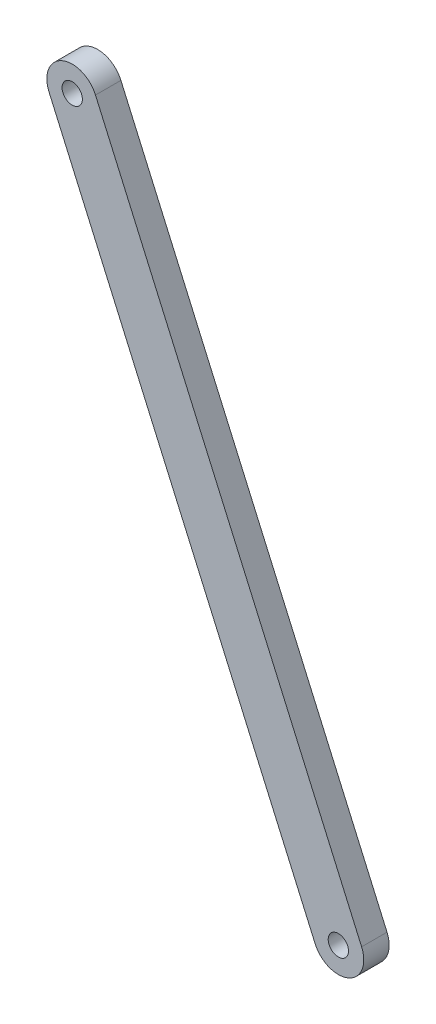
ISO-10303-21;
HEADER;
FILE_DESCRIPTION(('STEP AP214'),'2;1');
FILE_NAME('part.step','',(''),(''),'','','');
FILE_SCHEMA(('AUTOMOTIVE_DESIGN { 1 0 10303 214 1 1 1 1 }'));
ENDSEC;
DATA;
#1=APPLICATION_CONTEXT('core data for automotive mechanical design processes');
#2=APPLICATION_PROTOCOL_DEFINITION('international standard','automotive_design',2000,#1);
#3=PRODUCT_CONTEXT('',#1,'mechanical');
#4=PRODUCT('Part','Part','',(#3));
#5=PRODUCT_RELATED_PRODUCT_CATEGORY('part','',(#4));
#6=PRODUCT_DEFINITION_FORMATION('','',#4);
#7=PRODUCT_DEFINITION_CONTEXT('part definition',#1,'design');
#8=PRODUCT_DEFINITION('design','',#6,#7);
#9=PRODUCT_DEFINITION_SHAPE('','',#8);
#10=(LENGTH_UNIT() NAMED_UNIT(*) SI_UNIT(.MILLI.,.METRE.));
#11=(NAMED_UNIT(*) PLANE_ANGLE_UNIT() SI_UNIT($,.RADIAN.));
#12=(NAMED_UNIT(*) SI_UNIT($,.STERADIAN.) SOLID_ANGLE_UNIT());
#13=UNCERTAINTY_MEASURE_WITH_UNIT(LENGTH_MEASURE(1.E-05),#10,'distance_accuracy_value','');
#14=(GEOMETRIC_REPRESENTATION_CONTEXT(3) GLOBAL_UNCERTAINTY_ASSIGNED_CONTEXT((#13)) GLOBAL_UNIT_ASSIGNED_CONTEXT((#10,
#11,#12)) REPRESENTATION_CONTEXT('',''));
#15=CARTESIAN_POINT('',(0.,0.,0.));
#16=DIRECTION('',(0.,0.,1.));
#17=DIRECTION('',(1.,0.,0.));
#18=AXIS2_PLACEMENT_3D('',#15,#16,#17);
#19=CARTESIAN_POINT('',(-79.3875454378019,156.268923770412,-10.));
#20=DIRECTION('',(0.,0.,1.));
#21=DIRECTION('',(1.,0.,0.));
#22=AXIS2_PLACEMENT_3D('',#19,#20,#21);
#23=CYLINDRICAL_SURFACE('',#22,5.00000000000001);
#24=CARTESIAN_POINT('',(-79.3875454378019,156.268923770412,-5.));
#25=DIRECTION('',(0.,0.,1.));
#26=DIRECTION('',(1.,0.,0.));
#27=AXIS2_PLACEMENT_3D('',#24,#25,#26);
#28=CIRCLE('',#27,5.00000000000001);
#29=CARTESIAN_POINT('',(-74.8111879193475,158.283111413926,-5.));
#30=VERTEX_POINT('',#29);
#31=CARTESIAN_POINT('',(-83.9639029562564,154.254736126898,-5.));
#32=VERTEX_POINT('',#31);
#33=EDGE_CURVE('E98',#30,#32,#28,.T.);
#34=ORIENTED_EDGE('',*,*,#33,.F.);
#35=DIRECTION('',(0.,0.,1.));
#36=VECTOR('',#35,1.);
#37=CARTESIAN_POINT('',(-74.8111879193475,158.283111413926,-10.));
#38=LINE('',#37,#36);
#39=CARTESIAN_POINT('',(-74.8111879193475,158.283111413926,-10.));
#40=VERTEX_POINT('',#39);
#41=EDGE_CURVE('E11',#40,#30,#38,.T.);
#42=ORIENTED_EDGE('',*,*,#41,.F.);
#43=CARTESIAN_POINT('',(-79.3875454378019,156.268923770412,-10.));
#44=DIRECTION('',(0.,0.,1.));
#45=DIRECTION('',(1.,0.,0.));
#46=AXIS2_PLACEMENT_3D('',#43,#44,#45);
#47=CIRCLE('',#46,5.00000000000001);
#48=CARTESIAN_POINT('',(-83.9639029562564,154.254736126898,-10.));
#49=VERTEX_POINT('',#48);
#50=EDGE_CURVE('E91',#40,#49,#47,.T.);
#51=ORIENTED_EDGE('',*,*,#50,.T.);
#52=DIRECTION('',(0.,0.,1.));
#53=VECTOR('',#52,1.);
#54=CARTESIAN_POINT('',(-83.9639029562564,154.254736126898,-10.));
#55=LINE('',#54,#53);
#56=EDGE_CURVE('E36',#49,#32,#55,.T.);
#57=ORIENTED_EDGE('',*,*,#56,.T.);
#58=EDGE_LOOP('',(#34,#42,#51,#57));
#59=FACE_BOUND('',#58,.T.);
#60=ADVANCED_FACE('F33',(#59),#23,.T.);
#61=CARTESIAN_POINT('',(-74.8111879193475,158.283111413926,-10.));
#62=DIRECTION('',(0.915271503690887,0.402837528702853,0.));
#63=DIRECTION('',(-0.402837528702853,0.915271503690887,0.));
#64=AXIS2_PLACEMENT_3D('',#61,#62,#63);
#65=PLANE('',#64);
#66=DIRECTION('',(-0.402837528702853,0.915271503690887,0.));
#67=VECTOR('',#66,1.);
#68=CARTESIAN_POINT('',(-74.8111879193475,158.283111413926,-5.));
#69=LINE('',#68,#67);
#70=CARTESIAN_POINT('',(-22.4423091879765,39.297815934111,-5.));
#71=VERTEX_POINT('',#70);
#72=EDGE_CURVE('E93',#71,#30,#69,.T.);
#73=ORIENTED_EDGE('',*,*,#72,.F.);
#74=DIRECTION('',(0.,0.,1.));
#75=VECTOR('',#74,1.);
#76=CARTESIAN_POINT('',(-22.4423091879765,39.297815934111,-10.));
#77=LINE('',#76,#75);
#78=CARTESIAN_POINT('',(-22.4423091879765,39.297815934111,-10.));
#79=VERTEX_POINT('',#78);
#80=EDGE_CURVE('E42',#79,#71,#77,.T.);
#81=ORIENTED_EDGE('',*,*,#80,.F.);
#82=DIRECTION('',(-0.402837528702853,0.915271503690887,0.));
#83=VECTOR('',#82,1.);
#84=CARTESIAN_POINT('',(-74.8111879193475,158.283111413926,-10.));
#85=LINE('',#84,#83);
#86=EDGE_CURVE('E88',#79,#40,#85,.T.);
#87=ORIENTED_EDGE('',*,*,#86,.T.);
#88=ORIENTED_EDGE('',*,*,#41,.T.);
#89=EDGE_LOOP('',(#73,#81,#87,#88));
#90=FACE_BOUND('',#89,.T.);
#91=ADVANCED_FACE('F109',(#90),#65,.T.);
#92=CARTESIAN_POINT('',(-27.0186667064306,37.283628290596,-10.));
#93=DIRECTION('',(0.,0.,1.));
#94=DIRECTION('',(1.,0.,0.));
#95=AXIS2_PLACEMENT_3D('',#92,#93,#94);
#96=CYLINDRICAL_SURFACE('',#95,5.);
#97=CARTESIAN_POINT('',(-27.0186667064306,37.283628290596,-5.));
#98=DIRECTION('',(0.,0.,1.));
#99=DIRECTION('',(1.,0.,0.));
#100=AXIS2_PLACEMENT_3D('',#97,#98,#99);
#101=CIRCLE('',#100,5.);
#102=CARTESIAN_POINT('',(-31.5950242248854,35.2694406470824,-5.));
#103=VERTEX_POINT('',#102);
#104=EDGE_CURVE('E83',#103,#71,#101,.T.);
#105=ORIENTED_EDGE('',*,*,#104,.F.);
#106=DIRECTION('',(0.,0.,1.));
#107=VECTOR('',#106,1.);
#108=CARTESIAN_POINT('',(-31.5950242248854,35.2694406470824,-10.));
#109=LINE('',#108,#107);
#110=CARTESIAN_POINT('',(-31.5950242248854,35.2694406470824,-10.));
#111=VERTEX_POINT('',#110);
#112=EDGE_CURVE('E78',#111,#103,#109,.T.);
#113=ORIENTED_EDGE('',*,*,#112,.F.);
#114=CARTESIAN_POINT('',(-27.0186667064306,37.283628290596,-10.));
#115=DIRECTION('',(0.,0.,1.));
#116=DIRECTION('',(1.,0.,0.));
#117=AXIS2_PLACEMENT_3D('',#114,#115,#116);
#118=CIRCLE('',#117,5.);
#119=EDGE_CURVE('E81',#111,#79,#118,.T.);
#120=ORIENTED_EDGE('',*,*,#119,.T.);
#121=ORIENTED_EDGE('',*,*,#80,.T.);
#122=EDGE_LOOP('',(#105,#113,#120,#121));
#123=FACE_BOUND('',#122,.T.);
#124=ADVANCED_FACE('F80',(#123),#96,.T.);
#125=CARTESIAN_POINT('',(-31.5950242248854,35.2694406470824,-10.));
#126=DIRECTION('',(-0.915271503690887,-0.402837528702853,0.));
#127=DIRECTION('',(0.402837528702853,-0.915271503690887,0.));
#128=AXIS2_PLACEMENT_3D('',#125,#126,#127);
#129=PLANE('',#128);
#130=DIRECTION('',(0.402837528702853,-0.915271503690887,0.));
#131=VECTOR('',#130,1.);
#132=CARTESIAN_POINT('',(-31.5950242248854,35.2694406470824,-5.));
#133=LINE('',#132,#131);
#134=EDGE_CURVE('E101',#32,#103,#133,.T.);
#135=ORIENTED_EDGE('',*,*,#134,.F.);
#136=ORIENTED_EDGE('',*,*,#56,.F.);
#137=DIRECTION('',(0.402837528702853,-0.915271503690887,0.));
#138=VECTOR('',#137,1.);
#139=CARTESIAN_POINT('',(-31.5950242248854,35.2694406470824,-10.));
#140=LINE('',#139,#138);
#141=EDGE_CURVE('E87',#49,#111,#140,.T.);
#142=ORIENTED_EDGE('',*,*,#141,.T.);
#143=ORIENTED_EDGE('',*,*,#112,.T.);
#144=EDGE_LOOP('',(#135,#136,#142,#143));
#145=FACE_BOUND('',#144,.T.);
#146=ADVANCED_FACE('F90',(#145),#129,.T.);
#147=CARTESIAN_POINT('',(-79.3875454378019,156.268923770412,-10.));
#148=DIRECTION('',(0.,0.,1.));
#149=DIRECTION('',(1.,0.,0.));
#150=AXIS2_PLACEMENT_3D('',#147,#148,#149);
#151=PLANE('',#150);
#152=CARTESIAN_POINT('',(-27.0186667064306,37.283628290596,-10.));
#153=DIRECTION('',(0.,0.,1.));
#154=DIRECTION('',(1.,0.,0.));
#155=AXIS2_PLACEMENT_3D('',#152,#153,#154);
#156=CIRCLE('',#155,2.00000000000051);
#157=CARTESIAN_POINT('',(-25.0186667064301,37.283628290596,-10.));
#158=VERTEX_POINT('',#157);
#159=EDGE_CURVE('E142',#158,#158,#156,.T.);
#160=ORIENTED_EDGE('',*,*,#159,.T.);
#161=EDGE_LOOP('',(#160));
#162=FACE_BOUND('',#161,.T.);
#163=CARTESIAN_POINT('',(-79.3875454378019,156.268923770412,-10.));
#164=DIRECTION('',(0.,0.,1.));
#165=DIRECTION('',(1.,0.,0.));
#166=AXIS2_PLACEMENT_3D('',#163,#164,#165);
#167=CIRCLE('',#166,2.00000000000124);
#168=CARTESIAN_POINT('',(-77.3875454378007,156.268923770412,-10.));
#169=VERTEX_POINT('',#168);
#170=EDGE_CURVE('E102',#169,#169,#167,.T.);
#171=ORIENTED_EDGE('',*,*,#170,.T.);
#172=EDGE_LOOP('',(#171));
#173=FACE_BOUND('',#172,.T.);
#174=ORIENTED_EDGE('',*,*,#50,.F.);
#175=ORIENTED_EDGE('',*,*,#86,.F.);
#176=ORIENTED_EDGE('',*,*,#119,.F.);
#177=ORIENTED_EDGE('',*,*,#141,.F.);
#178=EDGE_LOOP('',(#174,#175,#176,#177));
#179=FACE_BOUND('',#178,.T.);
#180=ADVANCED_FACE('F86',(#162,#173,#179),#151,.F.);
#181=CARTESIAN_POINT('',(-79.3875454378019,156.268923770412,-5.));
#182=DIRECTION('',(0.,0.,1.));
#183=DIRECTION('',(1.,0.,0.));
#184=AXIS2_PLACEMENT_3D('',#181,#182,#183);
#185=PLANE('',#184);
#186=CARTESIAN_POINT('',(-27.0186667064306,37.283628290596,-5.));
#187=DIRECTION('',(0.,0.,1.));
#188=DIRECTION('',(1.,0.,0.));
#189=AXIS2_PLACEMENT_3D('',#186,#187,#188);
#190=CIRCLE('',#189,2.00000000000051);
#191=CARTESIAN_POINT('',(-25.0186667064301,37.283628290596,-5.));
#192=VERTEX_POINT('',#191);
#193=EDGE_CURVE('E145',#192,#192,#190,.T.);
#194=ORIENTED_EDGE('',*,*,#193,.F.);
#195=EDGE_LOOP('',(#194));
#196=FACE_BOUND('',#195,.T.);
#197=CARTESIAN_POINT('',(-79.3875454378019,156.268923770412,-5.));
#198=DIRECTION('',(0.,0.,1.));
#199=DIRECTION('',(1.,0.,0.));
#200=AXIS2_PLACEMENT_3D('',#197,#198,#199);
#201=CIRCLE('',#200,2.00000000000124);
#202=CARTESIAN_POINT('',(-77.3875454378007,156.268923770412,-5.));
#203=VERTEX_POINT('',#202);
#204=EDGE_CURVE('E147',#203,#203,#201,.T.);
#205=ORIENTED_EDGE('',*,*,#204,.F.);
#206=EDGE_LOOP('',(#205));
#207=FACE_BOUND('',#206,.T.);
#208=ORIENTED_EDGE('',*,*,#33,.T.);
#209=ORIENTED_EDGE('',*,*,#134,.T.);
#210=ORIENTED_EDGE('',*,*,#104,.T.);
#211=ORIENTED_EDGE('',*,*,#72,.T.);
#212=EDGE_LOOP('',(#208,#209,#210,#211));
#213=FACE_BOUND('',#212,.T.);
#214=ADVANCED_FACE('F108',(#196,#207,#213),#185,.T.);
#215=CARTESIAN_POINT('',(-79.3875454378019,156.268923770412,-10.));
#216=DIRECTION('',(0.,0.,1.));
#217=DIRECTION('',(1.,0.,0.));
#218=AXIS2_PLACEMENT_3D('',#215,#216,#217);
#219=CYLINDRICAL_SURFACE('',#218,2.00000000000124);
#220=ORIENTED_EDGE('',*,*,#170,.F.);
#221=EDGE_LOOP('',(#220));
#222=FACE_BOUND('',#221,.T.);
#223=ORIENTED_EDGE('',*,*,#204,.T.);
#224=EDGE_LOOP('',(#223));
#225=FACE_BOUND('',#224,.T.);
#226=ADVANCED_FACE('F127',(#222,#225),#219,.F.);
#227=CARTESIAN_POINT('',(-27.0186667064306,37.283628290596,-10.));
#228=DIRECTION('',(0.,0.,1.));
#229=DIRECTION('',(1.,0.,0.));
#230=AXIS2_PLACEMENT_3D('',#227,#228,#229);
#231=CYLINDRICAL_SURFACE('',#230,2.00000000000051);
#232=ORIENTED_EDGE('',*,*,#159,.F.);
#233=EDGE_LOOP('',(#232));
#234=FACE_BOUND('',#233,.T.);
#235=ORIENTED_EDGE('',*,*,#193,.T.);
#236=EDGE_LOOP('',(#235));
#237=FACE_BOUND('',#236,.T.);
#238=ADVANCED_FACE('F134',(#234,#237),#231,.F.);
#239=CLOSED_SHELL('',(#60,#91,#124,#146,#180,#214,#226,#238));
#240=MANIFOLD_SOLID_BREP('B2',#239);
#241=ADVANCED_BREP_SHAPE_REPRESENTATION('',(#18,#240),#14);
#242=SHAPE_DEFINITION_REPRESENTATION(#9,#241);
ENDSEC;
END-ISO-10303-21;
